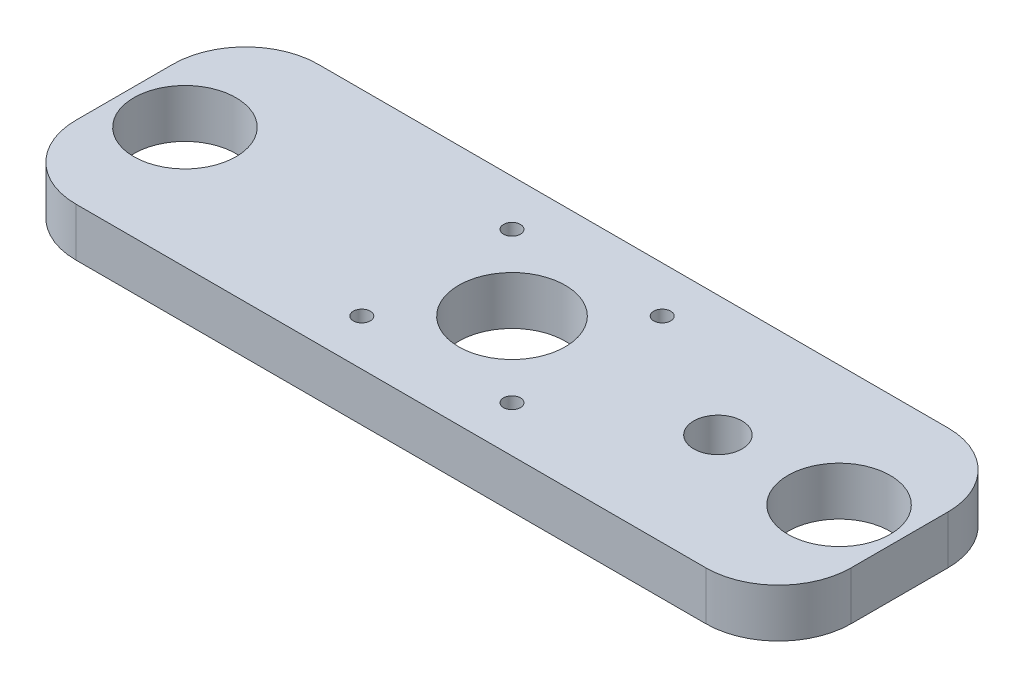
ISO-10303-21;
HEADER;
FILE_DESCRIPTION(('STEP AP214'),'2;1');
FILE_NAME('part.step','',(''),(''),'','','');
FILE_SCHEMA(('AUTOMOTIVE_DESIGN { 1 0 10303 214 1 1 1 1 }'));
ENDSEC;
DATA;
#1=APPLICATION_CONTEXT('core data for automotive mechanical design processes');
#2=APPLICATION_PROTOCOL_DEFINITION('international standard','automotive_design',2000,#1);
#3=PRODUCT_CONTEXT('',#1,'mechanical');
#4=PRODUCT('Part','Part','',(#3));
#5=PRODUCT_RELATED_PRODUCT_CATEGORY('part','',(#4));
#6=PRODUCT_DEFINITION_FORMATION('','',#4);
#7=PRODUCT_DEFINITION_CONTEXT('part definition',#1,'design');
#8=PRODUCT_DEFINITION('design','',#6,#7);
#9=PRODUCT_DEFINITION_SHAPE('','',#8);
#10=(LENGTH_UNIT() NAMED_UNIT(*) SI_UNIT(.MILLI.,.METRE.));
#11=(NAMED_UNIT(*) PLANE_ANGLE_UNIT() SI_UNIT($,.RADIAN.));
#12=(NAMED_UNIT(*) SI_UNIT($,.STERADIAN.) SOLID_ANGLE_UNIT());
#13=UNCERTAINTY_MEASURE_WITH_UNIT(LENGTH_MEASURE(1.E-05),#10,'distance_accuracy_value','');
#14=(GEOMETRIC_REPRESENTATION_CONTEXT(3) GLOBAL_UNCERTAINTY_ASSIGNED_CONTEXT((#13)) GLOBAL_UNIT_ASSIGNED_CONTEXT((#10,
#11,#12)) REPRESENTATION_CONTEXT('',''));
#15=CARTESIAN_POINT('',(0.,0.,0.));
#16=DIRECTION('',(0.,0.,1.));
#17=DIRECTION('',(1.,0.,0.));
#18=AXIS2_PLACEMENT_3D('',#15,#16,#17);
#19=CARTESIAN_POINT('',(0.,10.,0.));
#20=DIRECTION('',(0.,-1.,0.));
#21=DIRECTION('',(0.,0.,-1.));
#22=AXIS2_PLACEMENT_3D('',#19,#20,#21);
#23=PLANE('',#22);
#24=DIRECTION('',(1.,0.,0.));
#25=VECTOR('',#24,1.);
#26=CARTESIAN_POINT('',(-80.,10.,25.));
#27=LINE('',#26,#25);
#28=CARTESIAN_POINT('',(-65.,10.,25.));
#29=VERTEX_POINT('',#28);
#30=CARTESIAN_POINT('',(65.,10.,25.));
#31=VERTEX_POINT('',#30);
#32=EDGE_CURVE('E139',#29,#31,#27,.T.);
#33=ORIENTED_EDGE('',*,*,#32,.T.);
#34=CARTESIAN_POINT('',(65.,10.,10.));
#35=DIRECTION('',(0.,-1.,0.));
#36=DIRECTION('',(0.,0.,-1.));
#37=AXIS2_PLACEMENT_3D('',#34,#35,#36);
#38=CIRCLE('',#37,15.);
#39=CARTESIAN_POINT('',(80.,10.,10.));
#40=VERTEX_POINT('',#39);
#41=EDGE_CURVE('E158',#31,#40,#38,.F.);
#42=ORIENTED_EDGE('',*,*,#41,.T.);
#43=DIRECTION('',(0.,0.,-1.));
#44=VECTOR('',#43,1.);
#45=CARTESIAN_POINT('',(80.,10.,25.));
#46=LINE('',#45,#44);
#47=CARTESIAN_POINT('',(80.,10.,-10.));
#48=VERTEX_POINT('',#47);
#49=EDGE_CURVE('E122',#40,#48,#46,.T.);
#50=ORIENTED_EDGE('',*,*,#49,.T.);
#51=CARTESIAN_POINT('',(65.,10.,-10.));
#52=DIRECTION('',(0.,-1.,0.));
#53=DIRECTION('',(0.,0.,-1.));
#54=AXIS2_PLACEMENT_3D('',#51,#52,#53);
#55=CIRCLE('',#54,15.);
#56=CARTESIAN_POINT('',(65.,10.,-25.));
#57=VERTEX_POINT('',#56);
#58=EDGE_CURVE('E156',#48,#57,#55,.F.);
#59=ORIENTED_EDGE('',*,*,#58,.T.);
#60=DIRECTION('',(-1.,0.,0.));
#61=VECTOR('',#60,1.);
#62=CARTESIAN_POINT('',(-80.,10.,-25.));
#63=LINE('',#62,#61);
#64=CARTESIAN_POINT('',(-65.,10.,-25.));
#65=VERTEX_POINT('',#64);
#66=EDGE_CURVE('E169',#57,#65,#63,.T.);
#67=ORIENTED_EDGE('',*,*,#66,.T.);
#68=CARTESIAN_POINT('',(-65.,10.,-10.));
#69=DIRECTION('',(0.,-1.,0.));
#70=DIRECTION('',(0.,0.,-1.));
#71=AXIS2_PLACEMENT_3D('',#68,#69,#70);
#72=CIRCLE('',#71,15.);
#73=CARTESIAN_POINT('',(-80.,10.,-10.));
#74=VERTEX_POINT('',#73);
#75=EDGE_CURVE('E57',#65,#74,#72,.F.);
#76=ORIENTED_EDGE('',*,*,#75,.T.);
#77=DIRECTION('',(0.,0.,1.));
#78=VECTOR('',#77,1.);
#79=CARTESIAN_POINT('',(-80.,10.,25.));
#80=LINE('',#79,#78);
#81=CARTESIAN_POINT('',(-80.,10.,10.));
#82=VERTEX_POINT('',#81);
#83=EDGE_CURVE('E177',#74,#82,#80,.T.);
#84=ORIENTED_EDGE('',*,*,#83,.T.);
#85=CARTESIAN_POINT('',(-65.,10.,10.));
#86=DIRECTION('',(0.,-1.,0.));
#87=DIRECTION('',(0.,0.,-1.));
#88=AXIS2_PLACEMENT_3D('',#85,#86,#87);
#89=CIRCLE('',#88,15.);
#90=EDGE_CURVE('E153',#82,#29,#89,.F.);
#91=ORIENTED_EDGE('',*,*,#90,.T.);
#92=EDGE_LOOP('',(#33,#42,#50,#59,#67,#76,#84,#91));
#93=FACE_BOUND('',#92,.T.);
#94=CARTESIAN_POINT('',(0.,10.,0.));
#95=DIRECTION('',(0.,1.,0.));
#96=DIRECTION('',(0.,0.,1.));
#97=AXIS2_PLACEMENT_3D('',#94,#95,#96);
#98=CIRCLE('',#97,11.);
#99=CARTESIAN_POINT('',(0.,10.,11.));
#100=VERTEX_POINT('',#99);
#101=EDGE_CURVE('E130',#100,#100,#98,.T.);
#102=ORIENTED_EDGE('',*,*,#101,.F.);
#103=EDGE_LOOP('',(#102));
#104=FACE_BOUND('',#103,.T.);
#105=CARTESIAN_POINT('',(15.5,10.,-15.5));
#106=DIRECTION('',(0.,1.,0.));
#107=DIRECTION('',(0.,0.,1.));
#108=AXIS2_PLACEMENT_3D('',#105,#106,#107);
#109=CIRCLE('',#108,1.75);
#110=CARTESIAN_POINT('',(15.5,10.,-13.75));
#111=VERTEX_POINT('',#110);
#112=EDGE_CURVE('E184',#111,#111,#109,.T.);
#113=ORIENTED_EDGE('',*,*,#112,.F.);
#114=EDGE_LOOP('',(#113));
#115=FACE_BOUND('',#114,.T.);
#116=CARTESIAN_POINT('',(-15.5,10.,-15.5));
#117=DIRECTION('',(0.,1.,0.));
#118=DIRECTION('',(0.,0.,1.));
#119=AXIS2_PLACEMENT_3D('',#116,#117,#118);
#120=CIRCLE('',#119,1.75);
#121=CARTESIAN_POINT('',(-15.5,10.,-13.75));
#122=VERTEX_POINT('',#121);
#123=EDGE_CURVE('E189',#122,#122,#120,.T.);
#124=ORIENTED_EDGE('',*,*,#123,.F.);
#125=EDGE_LOOP('',(#124));
#126=FACE_BOUND('',#125,.T.);
#127=CARTESIAN_POINT('',(-15.5,10.,15.5));
#128=DIRECTION('',(0.,1.,0.));
#129=DIRECTION('',(0.,0.,1.));
#130=AXIS2_PLACEMENT_3D('',#127,#128,#129);
#131=CIRCLE('',#130,1.75);
#132=CARTESIAN_POINT('',(-15.5,10.,17.25));
#133=VERTEX_POINT('',#132);
#134=EDGE_CURVE('E195',#133,#133,#131,.T.);
#135=ORIENTED_EDGE('',*,*,#134,.F.);
#136=EDGE_LOOP('',(#135));
#137=FACE_BOUND('',#136,.T.);
#138=CARTESIAN_POINT('',(15.5,10.,15.5));
#139=DIRECTION('',(0.,1.,0.));
#140=DIRECTION('',(0.,0.,1.));
#141=AXIS2_PLACEMENT_3D('',#138,#139,#140);
#142=CIRCLE('',#141,1.75);
#143=CARTESIAN_POINT('',(15.5,10.,17.25));
#144=VERTEX_POINT('',#143);
#145=EDGE_CURVE('E201',#144,#144,#142,.T.);
#146=ORIENTED_EDGE('',*,*,#145,.F.);
#147=EDGE_LOOP('',(#146));
#148=FACE_BOUND('',#147,.T.);
#149=CARTESIAN_POINT('',(-67.5,10.,0.));
#150=DIRECTION('',(0.,1.,0.));
#151=DIRECTION('',(0.,0.,1.));
#152=AXIS2_PLACEMENT_3D('',#149,#150,#151);
#153=CIRCLE('',#152,10.55);
#154=CARTESIAN_POINT('',(-67.5,10.,10.55));
#155=VERTEX_POINT('',#154);
#156=EDGE_CURVE('E207',#155,#155,#153,.T.);
#157=ORIENTED_EDGE('',*,*,#156,.F.);
#158=EDGE_LOOP('',(#157));
#159=FACE_BOUND('',#158,.T.);
#160=CARTESIAN_POINT('',(67.5,10.,0.));
#161=DIRECTION('',(0.,1.,0.));
#162=DIRECTION('',(0.,0.,1.));
#163=AXIS2_PLACEMENT_3D('',#160,#161,#162);
#164=CIRCLE('',#163,10.55);
#165=CARTESIAN_POINT('',(67.5,10.,10.55));
#166=VERTEX_POINT('',#165);
#167=EDGE_CURVE('E213',#166,#166,#164,.T.);
#168=ORIENTED_EDGE('',*,*,#167,.F.);
#169=EDGE_LOOP('',(#168));
#170=FACE_BOUND('',#169,.T.);
#171=CARTESIAN_POINT('',(42.5,10.,0.));
#172=DIRECTION('',(0.,1.,0.));
#173=DIRECTION('',(0.,0.,1.));
#174=AXIS2_PLACEMENT_3D('',#171,#172,#173);
#175=CIRCLE('',#174,5.);
#176=CARTESIAN_POINT('',(42.5,10.,5.));
#177=VERTEX_POINT('',#176);
#178=EDGE_CURVE('E219',#177,#177,#175,.T.);
#179=ORIENTED_EDGE('',*,*,#178,.F.);
#180=EDGE_LOOP('',(#179));
#181=FACE_BOUND('',#180,.T.);
#182=ADVANCED_FACE('F36',(#93,#104,#115,#126,#137,#148,#159,#170,#181),#23,.F.);
#183=CARTESIAN_POINT('',(0.,0.,0.));
#184=DIRECTION('',(0.,-1.,0.));
#185=DIRECTION('',(0.,0.,-1.));
#186=AXIS2_PLACEMENT_3D('',#183,#184,#185);
#187=PLANE('',#186);
#188=CARTESIAN_POINT('',(67.5,0.,0.));
#189=DIRECTION('',(0.,1.,0.));
#190=DIRECTION('',(0.,0.,1.));
#191=AXIS2_PLACEMENT_3D('',#188,#189,#190);
#192=CIRCLE('',#191,10.55);
#193=CARTESIAN_POINT('',(67.5,0.,10.55));
#194=VERTEX_POINT('',#193);
#195=EDGE_CURVE('E216',#194,#194,#192,.T.);
#196=ORIENTED_EDGE('',*,*,#195,.T.);
#197=EDGE_LOOP('',(#196));
#198=FACE_BOUND('',#197,.T.);
#199=CARTESIAN_POINT('',(15.5,0.,15.5));
#200=DIRECTION('',(0.,1.,0.));
#201=DIRECTION('',(0.,0.,1.));
#202=AXIS2_PLACEMENT_3D('',#199,#200,#201);
#203=CIRCLE('',#202,1.75);
#204=CARTESIAN_POINT('',(15.5,0.,17.25));
#205=VERTEX_POINT('',#204);
#206=EDGE_CURVE('E204',#205,#205,#203,.T.);
#207=ORIENTED_EDGE('',*,*,#206,.T.);
#208=EDGE_LOOP('',(#207));
#209=FACE_BOUND('',#208,.T.);
#210=CARTESIAN_POINT('',(-15.5,0.,-15.5));
#211=DIRECTION('',(0.,1.,0.));
#212=DIRECTION('',(0.,0.,1.));
#213=AXIS2_PLACEMENT_3D('',#210,#211,#212);
#214=CIRCLE('',#213,1.75);
#215=CARTESIAN_POINT('',(-15.5,0.,-13.75));
#216=VERTEX_POINT('',#215);
#217=EDGE_CURVE('E192',#216,#216,#214,.T.);
#218=ORIENTED_EDGE('',*,*,#217,.T.);
#219=EDGE_LOOP('',(#218));
#220=FACE_BOUND('',#219,.T.);
#221=CARTESIAN_POINT('',(0.,0.,0.));
#222=DIRECTION('',(0.,1.,0.));
#223=DIRECTION('',(0.,0.,1.));
#224=AXIS2_PLACEMENT_3D('',#221,#222,#223);
#225=CIRCLE('',#224,11.);
#226=CARTESIAN_POINT('',(0.,0.,11.));
#227=VERTEX_POINT('',#226);
#228=EDGE_CURVE('E136',#227,#227,#225,.T.);
#229=ORIENTED_EDGE('',*,*,#228,.T.);
#230=EDGE_LOOP('',(#229));
#231=FACE_BOUND('',#230,.T.);
#232=DIRECTION('',(0.,0.,-1.));
#233=VECTOR('',#232,1.);
#234=CARTESIAN_POINT('',(80.,0.,25.));
#235=LINE('',#234,#233);
#236=CARTESIAN_POINT('',(80.,0.,10.));
#237=VERTEX_POINT('',#236);
#238=CARTESIAN_POINT('',(80.,0.,-10.));
#239=VERTEX_POINT('',#238);
#240=EDGE_CURVE('E119',#237,#239,#235,.T.);
#241=ORIENTED_EDGE('',*,*,#240,.F.);
#242=CARTESIAN_POINT('',(65.,0.,10.));
#243=DIRECTION('',(0.,-1.,0.));
#244=DIRECTION('',(0.,0.,-1.));
#245=AXIS2_PLACEMENT_3D('',#242,#243,#244);
#246=CIRCLE('',#245,15.);
#247=CARTESIAN_POINT('',(65.,0.,25.));
#248=VERTEX_POINT('',#247);
#249=EDGE_CURVE('E102',#237,#248,#246,.T.);
#250=ORIENTED_EDGE('',*,*,#249,.T.);
#251=DIRECTION('',(1.,0.,0.));
#252=VECTOR('',#251,1.);
#253=CARTESIAN_POINT('',(-80.,0.,25.));
#254=LINE('',#253,#252);
#255=CARTESIAN_POINT('',(-65.,0.,25.));
#256=VERTEX_POINT('',#255);
#257=EDGE_CURVE('E143',#256,#248,#254,.T.);
#258=ORIENTED_EDGE('',*,*,#257,.F.);
#259=CARTESIAN_POINT('',(-65.,0.,10.));
#260=DIRECTION('',(0.,-1.,0.));
#261=DIRECTION('',(0.,0.,-1.));
#262=AXIS2_PLACEMENT_3D('',#259,#260,#261);
#263=CIRCLE('',#262,15.);
#264=CARTESIAN_POINT('',(-80.,0.,10.));
#265=VERTEX_POINT('',#264);
#266=EDGE_CURVE('E123',#256,#265,#263,.T.);
#267=ORIENTED_EDGE('',*,*,#266,.T.);
#268=DIRECTION('',(0.,0.,1.));
#269=VECTOR('',#268,1.);
#270=CARTESIAN_POINT('',(-80.,0.,25.));
#271=LINE('',#270,#269);
#272=CARTESIAN_POINT('',(-80.,0.,-10.));
#273=VERTEX_POINT('',#272);
#274=EDGE_CURVE('E133',#273,#265,#271,.T.);
#275=ORIENTED_EDGE('',*,*,#274,.F.);
#276=CARTESIAN_POINT('',(-65.,0.,-10.));
#277=DIRECTION('',(0.,-1.,0.));
#278=DIRECTION('',(0.,0.,-1.));
#279=AXIS2_PLACEMENT_3D('',#276,#277,#278);
#280=CIRCLE('',#279,15.);
#281=CARTESIAN_POINT('',(-65.,0.,-25.));
#282=VERTEX_POINT('',#281);
#283=EDGE_CURVE('E147',#273,#282,#280,.T.);
#284=ORIENTED_EDGE('',*,*,#283,.T.);
#285=DIRECTION('',(-1.,0.,0.));
#286=VECTOR('',#285,1.);
#287=CARTESIAN_POINT('',(-80.,0.,-25.));
#288=LINE('',#287,#286);
#289=CARTESIAN_POINT('',(65.,0.,-25.));
#290=VERTEX_POINT('',#289);
#291=EDGE_CURVE('E129',#290,#282,#288,.T.);
#292=ORIENTED_EDGE('',*,*,#291,.F.);
#293=CARTESIAN_POINT('',(65.,0.,-10.));
#294=DIRECTION('',(0.,-1.,0.));
#295=DIRECTION('',(0.,0.,-1.));
#296=AXIS2_PLACEMENT_3D('',#293,#294,#295);
#297=CIRCLE('',#296,15.);
#298=EDGE_CURVE('E113',#290,#239,#297,.T.);
#299=ORIENTED_EDGE('',*,*,#298,.T.);
#300=EDGE_LOOP('',(#241,#250,#258,#267,#275,#284,#292,#299));
#301=FACE_BOUND('',#300,.T.);
#302=CARTESIAN_POINT('',(15.5,0.,-15.5));
#303=DIRECTION('',(0.,1.,0.));
#304=DIRECTION('',(0.,0.,1.));
#305=AXIS2_PLACEMENT_3D('',#302,#303,#304);
#306=CIRCLE('',#305,1.75);
#307=CARTESIAN_POINT('',(15.5,0.,-13.75));
#308=VERTEX_POINT('',#307);
#309=EDGE_CURVE('E186',#308,#308,#306,.T.);
#310=ORIENTED_EDGE('',*,*,#309,.T.);
#311=EDGE_LOOP('',(#310));
#312=FACE_BOUND('',#311,.T.);
#313=CARTESIAN_POINT('',(-15.5,0.,15.5));
#314=DIRECTION('',(0.,1.,0.));
#315=DIRECTION('',(0.,0.,1.));
#316=AXIS2_PLACEMENT_3D('',#313,#314,#315);
#317=CIRCLE('',#316,1.75);
#318=CARTESIAN_POINT('',(-15.5,0.,17.25));
#319=VERTEX_POINT('',#318);
#320=EDGE_CURVE('E198',#319,#319,#317,.T.);
#321=ORIENTED_EDGE('',*,*,#320,.T.);
#322=EDGE_LOOP('',(#321));
#323=FACE_BOUND('',#322,.T.);
#324=CARTESIAN_POINT('',(-67.5,0.,0.));
#325=DIRECTION('',(0.,1.,0.));
#326=DIRECTION('',(0.,0.,1.));
#327=AXIS2_PLACEMENT_3D('',#324,#325,#326);
#328=CIRCLE('',#327,10.55);
#329=CARTESIAN_POINT('',(-67.5,0.,10.55));
#330=VERTEX_POINT('',#329);
#331=EDGE_CURVE('E210',#330,#330,#328,.T.);
#332=ORIENTED_EDGE('',*,*,#331,.T.);
#333=EDGE_LOOP('',(#332));
#334=FACE_BOUND('',#333,.T.);
#335=CARTESIAN_POINT('',(42.5,0.,0.));
#336=DIRECTION('',(0.,1.,0.));
#337=DIRECTION('',(0.,0.,1.));
#338=AXIS2_PLACEMENT_3D('',#335,#336,#337);
#339=CIRCLE('',#338,5.);
#340=CARTESIAN_POINT('',(42.5,0.,5.));
#341=VERTEX_POINT('',#340);
#342=EDGE_CURVE('E222',#341,#341,#339,.T.);
#343=ORIENTED_EDGE('',*,*,#342,.T.);
#344=EDGE_LOOP('',(#343));
#345=FACE_BOUND('',#344,.T.);
#346=ADVANCED_FACE('F126',(#198,#209,#220,#231,#301,#312,#323,#334,#345),#187,.T.);
#347=CARTESIAN_POINT('',(80.,10.,25.));
#348=DIRECTION('',(-1.,0.,0.));
#349=DIRECTION('',(0.,0.,1.));
#350=AXIS2_PLACEMENT_3D('',#347,#348,#349);
#351=PLANE('',#350);
#352=ORIENTED_EDGE('',*,*,#49,.F.);
#353=DIRECTION('',(0.,-1.,0.));
#354=VECTOR('',#353,1.);
#355=CARTESIAN_POINT('',(80.,10.,10.));
#356=LINE('',#355,#354);
#357=EDGE_CURVE('E106',#40,#237,#356,.T.);
#358=ORIENTED_EDGE('',*,*,#357,.T.);
#359=ORIENTED_EDGE('',*,*,#240,.T.);
#360=DIRECTION('',(0.,-1.,0.));
#361=VECTOR('',#360,1.);
#362=CARTESIAN_POINT('',(80.,10.,-10.));
#363=LINE('',#362,#361);
#364=EDGE_CURVE('E124',#239,#48,#363,.F.);
#365=ORIENTED_EDGE('',*,*,#364,.T.);
#366=EDGE_LOOP('',(#352,#358,#359,#365));
#367=FACE_BOUND('',#366,.T.);
#368=ADVANCED_FACE('F118',(#367),#351,.F.);
#369=CARTESIAN_POINT('',(-80.,10.,-25.));
#370=DIRECTION('',(0.,0.,1.));
#371=DIRECTION('',(1.,0.,0.));
#372=AXIS2_PLACEMENT_3D('',#369,#370,#371);
#373=PLANE('',#372);
#374=ORIENTED_EDGE('',*,*,#66,.F.);
#375=DIRECTION('',(0.,-1.,0.));
#376=VECTOR('',#375,1.);
#377=CARTESIAN_POINT('',(65.,10.,-25.));
#378=LINE('',#377,#376);
#379=EDGE_CURVE('E162',#57,#290,#378,.T.);
#380=ORIENTED_EDGE('',*,*,#379,.T.);
#381=ORIENTED_EDGE('',*,*,#291,.T.);
#382=DIRECTION('',(0.,-1.,0.));
#383=VECTOR('',#382,1.);
#384=CARTESIAN_POINT('',(-65.,10.,-25.));
#385=LINE('',#384,#383);
#386=EDGE_CURVE('E160',#282,#65,#385,.F.);
#387=ORIENTED_EDGE('',*,*,#386,.T.);
#388=EDGE_LOOP('',(#374,#380,#381,#387));
#389=FACE_BOUND('',#388,.T.);
#390=ADVANCED_FACE('F167',(#389),#373,.F.);
#391=CARTESIAN_POINT('',(-80.,10.,25.));
#392=DIRECTION('',(1.,0.,0.));
#393=DIRECTION('',(0.,0.,-1.));
#394=AXIS2_PLACEMENT_3D('',#391,#392,#393);
#395=PLANE('',#394);
#396=ORIENTED_EDGE('',*,*,#83,.F.);
#397=DIRECTION('',(0.,-1.,0.));
#398=VECTOR('',#397,1.);
#399=CARTESIAN_POINT('',(-80.,10.,-10.));
#400=LINE('',#399,#398);
#401=EDGE_CURVE('E11',#74,#273,#400,.T.);
#402=ORIENTED_EDGE('',*,*,#401,.T.);
#403=ORIENTED_EDGE('',*,*,#274,.T.);
#404=DIRECTION('',(0.,-1.,0.));
#405=VECTOR('',#404,1.);
#406=CARTESIAN_POINT('',(-80.,10.,10.));
#407=LINE('',#406,#405);
#408=EDGE_CURVE('E44',#265,#82,#407,.F.);
#409=ORIENTED_EDGE('',*,*,#408,.T.);
#410=EDGE_LOOP('',(#396,#402,#403,#409));
#411=FACE_BOUND('',#410,.T.);
#412=ADVANCED_FACE('F176',(#411),#395,.F.);
#413=CARTESIAN_POINT('',(-80.,10.,25.));
#414=DIRECTION('',(0.,0.,-1.));
#415=DIRECTION('',(-1.,0.,0.));
#416=AXIS2_PLACEMENT_3D('',#413,#414,#415);
#417=PLANE('',#416);
#418=ORIENTED_EDGE('',*,*,#257,.T.);
#419=DIRECTION('',(0.,-1.,0.));
#420=VECTOR('',#419,1.);
#421=CARTESIAN_POINT('',(65.,10.,25.));
#422=LINE('',#421,#420);
#423=EDGE_CURVE('E107',#248,#31,#422,.F.);
#424=ORIENTED_EDGE('',*,*,#423,.T.);
#425=ORIENTED_EDGE('',*,*,#32,.F.);
#426=DIRECTION('',(0.,-1.,0.));
#427=VECTOR('',#426,1.);
#428=CARTESIAN_POINT('',(-65.,10.,25.));
#429=LINE('',#428,#427);
#430=EDGE_CURVE('E112',#29,#256,#429,.T.);
#431=ORIENTED_EDGE('',*,*,#430,.T.);
#432=EDGE_LOOP('',(#418,#424,#425,#431));
#433=FACE_BOUND('',#432,.T.);
#434=ADVANCED_FACE('F243',(#433),#417,.F.);
#435=CARTESIAN_POINT('',(0.,10.,0.));
#436=DIRECTION('',(0.,-1.,0.));
#437=DIRECTION('',(0.,0.,-1.));
#438=AXIS2_PLACEMENT_3D('',#435,#436,#437);
#439=CYLINDRICAL_SURFACE('',#438,11.);
#440=ORIENTED_EDGE('',*,*,#101,.T.);
#441=EDGE_LOOP('',(#440));
#442=FACE_BOUND('',#441,.T.);
#443=ORIENTED_EDGE('',*,*,#228,.F.);
#444=EDGE_LOOP('',(#443));
#445=FACE_BOUND('',#444,.T.);
#446=ADVANCED_FACE('F240',(#442,#445),#439,.F.);
#447=CARTESIAN_POINT('',(15.5,10.,-15.5));
#448=DIRECTION('',(0.,-1.,0.));
#449=DIRECTION('',(0.,0.,-1.));
#450=AXIS2_PLACEMENT_3D('',#447,#448,#449);
#451=CYLINDRICAL_SURFACE('',#450,1.75);
#452=ORIENTED_EDGE('',*,*,#112,.T.);
#453=EDGE_LOOP('',(#452));
#454=FACE_BOUND('',#453,.T.);
#455=ORIENTED_EDGE('',*,*,#309,.F.);
#456=EDGE_LOOP('',(#455));
#457=FACE_BOUND('',#456,.T.);
#458=ADVANCED_FACE('F376',(#454,#457),#451,.F.);
#459=CARTESIAN_POINT('',(-15.5,10.,-15.5));
#460=DIRECTION('',(0.,-1.,0.));
#461=DIRECTION('',(0.,0.,-1.));
#462=AXIS2_PLACEMENT_3D('',#459,#460,#461);
#463=CYLINDRICAL_SURFACE('',#462,1.75);
#464=ORIENTED_EDGE('',*,*,#123,.T.);
#465=EDGE_LOOP('',(#464));
#466=FACE_BOUND('',#465,.T.);
#467=ORIENTED_EDGE('',*,*,#217,.F.);
#468=EDGE_LOOP('',(#467));
#469=FACE_BOUND('',#468,.T.);
#470=ADVANCED_FACE('F366',(#466,#469),#463,.F.);
#471=CARTESIAN_POINT('',(-15.5,10.,15.5));
#472=DIRECTION('',(0.,-1.,0.));
#473=DIRECTION('',(0.,0.,-1.));
#474=AXIS2_PLACEMENT_3D('',#471,#472,#473);
#475=CYLINDRICAL_SURFACE('',#474,1.75);
#476=ORIENTED_EDGE('',*,*,#134,.T.);
#477=EDGE_LOOP('',(#476));
#478=FACE_BOUND('',#477,.T.);
#479=ORIENTED_EDGE('',*,*,#320,.F.);
#480=EDGE_LOOP('',(#479));
#481=FACE_BOUND('',#480,.T.);
#482=ADVANCED_FACE('F356',(#478,#481),#475,.F.);
#483=CARTESIAN_POINT('',(15.5,10.,15.5));
#484=DIRECTION('',(0.,-1.,0.));
#485=DIRECTION('',(0.,0.,-1.));
#486=AXIS2_PLACEMENT_3D('',#483,#484,#485);
#487=CYLINDRICAL_SURFACE('',#486,1.75);
#488=ORIENTED_EDGE('',*,*,#145,.T.);
#489=EDGE_LOOP('',(#488));
#490=FACE_BOUND('',#489,.T.);
#491=ORIENTED_EDGE('',*,*,#206,.F.);
#492=EDGE_LOOP('',(#491));
#493=FACE_BOUND('',#492,.T.);
#494=ADVANCED_FACE('F346',(#490,#493),#487,.F.);
#495=CARTESIAN_POINT('',(-67.5,10.,0.));
#496=DIRECTION('',(0.,-1.,0.));
#497=DIRECTION('',(0.,0.,-1.));
#498=AXIS2_PLACEMENT_3D('',#495,#496,#497);
#499=CYLINDRICAL_SURFACE('',#498,10.55);
#500=ORIENTED_EDGE('',*,*,#156,.T.);
#501=EDGE_LOOP('',(#500));
#502=FACE_BOUND('',#501,.T.);
#503=ORIENTED_EDGE('',*,*,#331,.F.);
#504=EDGE_LOOP('',(#503));
#505=FACE_BOUND('',#504,.T.);
#506=ADVANCED_FACE('F336',(#502,#505),#499,.F.);
#507=CARTESIAN_POINT('',(67.5,10.,0.));
#508=DIRECTION('',(0.,-1.,0.));
#509=DIRECTION('',(0.,0.,-1.));
#510=AXIS2_PLACEMENT_3D('',#507,#508,#509);
#511=CYLINDRICAL_SURFACE('',#510,10.55);
#512=ORIENTED_EDGE('',*,*,#167,.T.);
#513=EDGE_LOOP('',(#512));
#514=FACE_BOUND('',#513,.T.);
#515=ORIENTED_EDGE('',*,*,#195,.F.);
#516=EDGE_LOOP('',(#515));
#517=FACE_BOUND('',#516,.T.);
#518=ADVANCED_FACE('F327',(#514,#517),#511,.F.);
#519=CARTESIAN_POINT('',(42.5,10.,0.));
#520=DIRECTION('',(0.,-1.,0.));
#521=DIRECTION('',(0.,0.,-1.));
#522=AXIS2_PLACEMENT_3D('',#519,#520,#521);
#523=CYLINDRICAL_SURFACE('',#522,5.);
#524=ORIENTED_EDGE('',*,*,#178,.T.);
#525=EDGE_LOOP('',(#524));
#526=FACE_BOUND('',#525,.T.);
#527=ORIENTED_EDGE('',*,*,#342,.F.);
#528=EDGE_LOOP('',(#527));
#529=FACE_BOUND('',#528,.T.);
#530=ADVANCED_FACE('F228',(#526,#529),#523,.F.);
#531=CARTESIAN_POINT('',(65.,10.,10.));
#532=DIRECTION('',(0.,-1.,0.));
#533=DIRECTION('',(0.,0.,-1.));
#534=AXIS2_PLACEMENT_3D('',#531,#532,#533);
#535=CYLINDRICAL_SURFACE('',#534,15.);
#536=ORIENTED_EDGE('',*,*,#41,.F.);
#537=ORIENTED_EDGE('',*,*,#423,.F.);
#538=ORIENTED_EDGE('',*,*,#249,.F.);
#539=ORIENTED_EDGE('',*,*,#357,.F.);
#540=EDGE_LOOP('',(#536,#537,#538,#539));
#541=FACE_BOUND('',#540,.T.);
#542=ADVANCED_FACE('F105',(#541),#535,.T.);
#543=CARTESIAN_POINT('',(65.,10.,-10.));
#544=DIRECTION('',(0.,-1.,0.));
#545=DIRECTION('',(0.,0.,-1.));
#546=AXIS2_PLACEMENT_3D('',#543,#544,#545);
#547=CYLINDRICAL_SURFACE('',#546,15.);
#548=ORIENTED_EDGE('',*,*,#58,.F.);
#549=ORIENTED_EDGE('',*,*,#364,.F.);
#550=ORIENTED_EDGE('',*,*,#298,.F.);
#551=ORIENTED_EDGE('',*,*,#379,.F.);
#552=EDGE_LOOP('',(#548,#549,#550,#551));
#553=FACE_BOUND('',#552,.T.);
#554=ADVANCED_FACE('F255',(#553),#547,.T.);
#555=CARTESIAN_POINT('',(-65.,10.,-10.));
#556=DIRECTION('',(0.,-1.,0.));
#557=DIRECTION('',(0.,0.,-1.));
#558=AXIS2_PLACEMENT_3D('',#555,#556,#557);
#559=CYLINDRICAL_SURFACE('',#558,15.);
#560=ORIENTED_EDGE('',*,*,#75,.F.);
#561=ORIENTED_EDGE('',*,*,#386,.F.);
#562=ORIENTED_EDGE('',*,*,#283,.F.);
#563=ORIENTED_EDGE('',*,*,#401,.F.);
#564=EDGE_LOOP('',(#560,#561,#562,#563));
#565=FACE_BOUND('',#564,.T.);
#566=ADVANCED_FACE('F175',(#565),#559,.T.);
#567=CARTESIAN_POINT('',(-65.,10.,10.));
#568=DIRECTION('',(0.,-1.,0.));
#569=DIRECTION('',(0.,0.,-1.));
#570=AXIS2_PLACEMENT_3D('',#567,#568,#569);
#571=CYLINDRICAL_SURFACE('',#570,15.);
#572=ORIENTED_EDGE('',*,*,#90,.F.);
#573=ORIENTED_EDGE('',*,*,#408,.F.);
#574=ORIENTED_EDGE('',*,*,#266,.F.);
#575=ORIENTED_EDGE('',*,*,#430,.F.);
#576=EDGE_LOOP('',(#572,#573,#574,#575));
#577=FACE_BOUND('',#576,.T.);
#578=ADVANCED_FACE('F38',(#577),#571,.T.);
#579=CLOSED_SHELL('',(#182,#346,#368,#390,#412,#434,#446,#458,#470,#482,#494,#506,#518,#530,
#542,#554,#566,#578));
#580=MANIFOLD_SOLID_BREP('B2',#579);
#581=ADVANCED_BREP_SHAPE_REPRESENTATION('',(#18,#580),#14);
#582=SHAPE_DEFINITION_REPRESENTATION(#9,#581);
ENDSEC;
END-ISO-10303-21;
